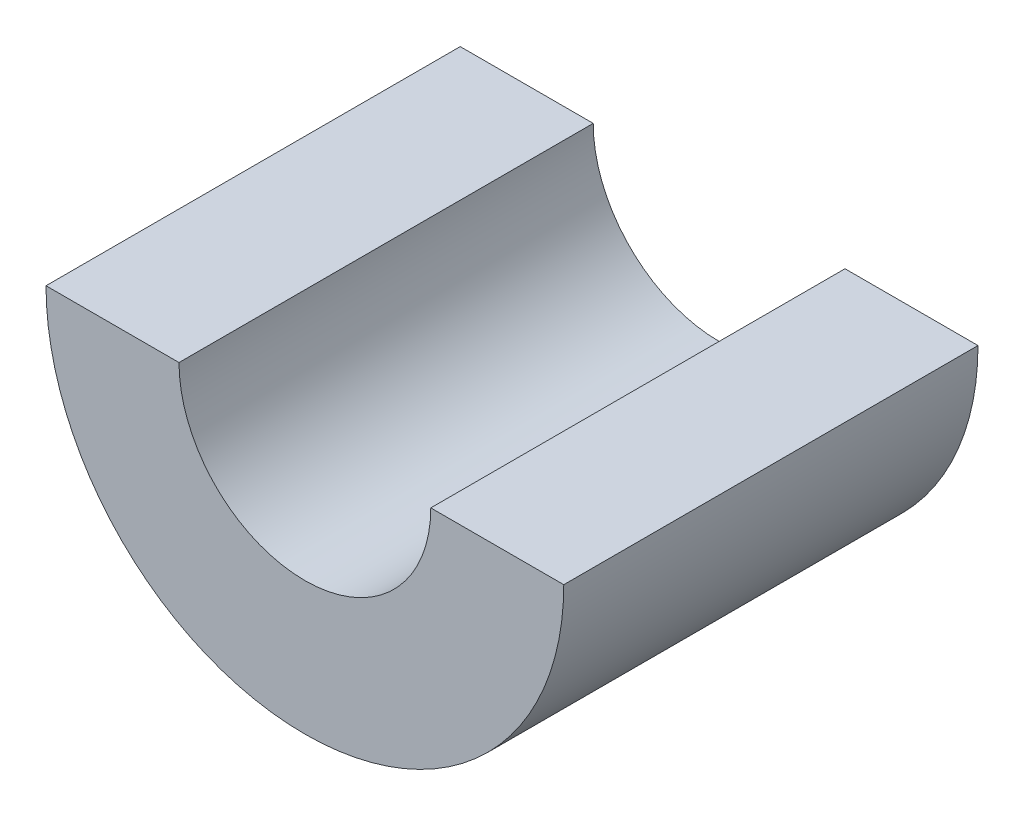
ISO-10303-21;
HEADER;
FILE_DESCRIPTION(('STEP AP214'),'2;1');
FILE_NAME('part.step','',(''),(''),'','','');
FILE_SCHEMA(('AUTOMOTIVE_DESIGN { 1 0 10303 214 1 1 1 1 }'));
ENDSEC;
DATA;
#1=APPLICATION_CONTEXT('core data for automotive mechanical design processes');
#2=APPLICATION_PROTOCOL_DEFINITION('international standard','automotive_design',2000,#1);
#3=PRODUCT_CONTEXT('',#1,'mechanical');
#4=PRODUCT('Part','Part','',(#3));
#5=PRODUCT_RELATED_PRODUCT_CATEGORY('part','',(#4));
#6=PRODUCT_DEFINITION_FORMATION('','',#4);
#7=PRODUCT_DEFINITION_CONTEXT('part definition',#1,'design');
#8=PRODUCT_DEFINITION('design','',#6,#7);
#9=PRODUCT_DEFINITION_SHAPE('','',#8);
#10=(LENGTH_UNIT() NAMED_UNIT(*) SI_UNIT(.MILLI.,.METRE.));
#11=(NAMED_UNIT(*) PLANE_ANGLE_UNIT() SI_UNIT($,.RADIAN.));
#12=(NAMED_UNIT(*) SI_UNIT($,.STERADIAN.) SOLID_ANGLE_UNIT());
#13=UNCERTAINTY_MEASURE_WITH_UNIT(LENGTH_MEASURE(1.E-05),#10,'distance_accuracy_value','');
#14=(GEOMETRIC_REPRESENTATION_CONTEXT(3) GLOBAL_UNCERTAINTY_ASSIGNED_CONTEXT((#13)) GLOBAL_UNIT_ASSIGNED_CONTEXT((#10,
#11,#12)) REPRESENTATION_CONTEXT('',''));
#15=CARTESIAN_POINT('',(0.,0.,0.));
#16=DIRECTION('',(0.,0.,1.));
#17=DIRECTION('',(1.,0.,0.));
#18=AXIS2_PLACEMENT_3D('',#15,#16,#17);
#19=CARTESIAN_POINT('',(0.,0.,8.));
#20=DIRECTION('',(0.,1.,0.));
#21=DIRECTION('',(0.,0.,1.));
#22=AXIS2_PLACEMENT_3D('',#19,#20,#21);
#23=PLANE('',#22);
#24=DIRECTION('',(1.,0.,0.));
#25=VECTOR('',#24,1.);
#26=CARTESIAN_POINT('',(0.,0.,0.));
#27=LINE('',#26,#25);
#28=CARTESIAN_POINT('',(-5.,0.,0.));
#29=VERTEX_POINT('',#28);
#30=CARTESIAN_POINT('',(-2.43137084989848,0.,0.));
#31=VERTEX_POINT('',#30);
#32=EDGE_CURVE('E122',#29,#31,#27,.T.);
#33=ORIENTED_EDGE('',*,*,#32,.F.);
#34=DIRECTION('',(0.,0.,-1.));
#35=VECTOR('',#34,1.);
#36=CARTESIAN_POINT('',(-5.,0.,8.));
#37=LINE('',#36,#35);
#38=CARTESIAN_POINT('',(-5.,0.,8.));
#39=VERTEX_POINT('',#38);
#40=EDGE_CURVE('E11',#39,#29,#37,.T.);
#41=ORIENTED_EDGE('',*,*,#40,.F.);
#42=DIRECTION('',(1.,0.,0.));
#43=VECTOR('',#42,1.);
#44=CARTESIAN_POINT('',(0.,0.,8.));
#45=LINE('',#44,#43);
#46=CARTESIAN_POINT('',(-2.43137084989848,0.,8.));
#47=VERTEX_POINT('',#46);
#48=EDGE_CURVE('E97',#39,#47,#45,.T.);
#49=ORIENTED_EDGE('',*,*,#48,.T.);
#50=DIRECTION('',(0.,0.,-1.));
#51=VECTOR('',#50,1.);
#52=CARTESIAN_POINT('',(-2.43137084989848,0.,8.));
#53=LINE('',#52,#51);
#54=EDGE_CURVE('E65',#47,#31,#53,.T.);
#55=ORIENTED_EDGE('',*,*,#54,.T.);
#56=EDGE_LOOP('',(#33,#41,#49,#55));
#57=FACE_BOUND('',#56,.T.);
#58=ADVANCED_FACE('F47',(#57),#23,.T.);
#59=CARTESIAN_POINT('',(0.,0.,8.));
#60=DIRECTION('',(0.,0.,-1.));
#61=DIRECTION('',(-1.,0.,0.));
#62=AXIS2_PLACEMENT_3D('',#59,#60,#61);
#63=CYLINDRICAL_SURFACE('',#62,5.);
#64=CARTESIAN_POINT('',(0.,0.,0.));
#65=DIRECTION('',(0.,0.,1.));
#66=DIRECTION('',(1.,0.,0.));
#67=AXIS2_PLACEMENT_3D('',#64,#65,#66);
#68=CIRCLE('',#67,5.);
#69=CARTESIAN_POINT('',(5.,0.,0.));
#70=VERTEX_POINT('',#69);
#71=EDGE_CURVE('E103',#29,#70,#68,.T.);
#72=ORIENTED_EDGE('',*,*,#71,.T.);
#73=DIRECTION('',(0.,0.,-1.));
#74=VECTOR('',#73,1.);
#75=CARTESIAN_POINT('',(5.,0.,8.));
#76=LINE('',#75,#74);
#77=CARTESIAN_POINT('',(5.,0.,8.));
#78=VERTEX_POINT('',#77);
#79=EDGE_CURVE('E57',#78,#70,#76,.T.);
#80=ORIENTED_EDGE('',*,*,#79,.F.);
#81=CARTESIAN_POINT('',(0.,0.,8.));
#82=DIRECTION('',(0.,0.,1.));
#83=DIRECTION('',(1.,0.,0.));
#84=AXIS2_PLACEMENT_3D('',#81,#82,#83);
#85=CIRCLE('',#84,5.);
#86=EDGE_CURVE('E91',#39,#78,#85,.T.);
#87=ORIENTED_EDGE('',*,*,#86,.F.);
#88=ORIENTED_EDGE('',*,*,#40,.T.);
#89=EDGE_LOOP('',(#72,#80,#87,#88));
#90=FACE_BOUND('',#89,.T.);
#91=ADVANCED_FACE('F49',(#90),#63,.T.);
#92=CARTESIAN_POINT('',(2.43137084989848,0.,0.));
#93=VERTEX_POINT('',#92);
#94=EDGE_CURVE('E117',#93,#70,#27,.T.);
#95=ORIENTED_EDGE('',*,*,#94,.F.);
#96=DIRECTION('',(0.,0.,-1.));
#97=VECTOR('',#96,1.);
#98=CARTESIAN_POINT('',(2.43137084989848,0.,8.));
#99=LINE('',#98,#97);
#100=CARTESIAN_POINT('',(2.43137084989848,0.,8.));
#101=VERTEX_POINT('',#100);
#102=EDGE_CURVE('E78',#101,#93,#99,.T.);
#103=ORIENTED_EDGE('',*,*,#102,.F.);
#104=EDGE_CURVE('E96',#101,#78,#45,.T.);
#105=ORIENTED_EDGE('',*,*,#104,.T.);
#106=ORIENTED_EDGE('',*,*,#79,.T.);
#107=EDGE_LOOP('',(#95,#103,#105,#106));
#108=FACE_BOUND('',#107,.T.);
#109=ADVANCED_FACE('F107',(#108),#23,.T.);
#110=CARTESIAN_POINT('',(0.,0.,8.));
#111=DIRECTION('',(0.,0.,-1.));
#112=DIRECTION('',(-1.,0.,0.));
#113=AXIS2_PLACEMENT_3D('',#110,#111,#112);
#114=CYLINDRICAL_SURFACE('',#113,2.43137084989848);
#115=CARTESIAN_POINT('',(0.,0.,0.));
#116=DIRECTION('',(0.,0.,1.));
#117=DIRECTION('',(1.,0.,0.));
#118=AXIS2_PLACEMENT_3D('',#115,#116,#117);
#119=CIRCLE('',#118,2.43137084989848);
#120=EDGE_CURVE('E114',#31,#93,#119,.T.);
#121=ORIENTED_EDGE('',*,*,#120,.F.);
#122=ORIENTED_EDGE('',*,*,#54,.F.);
#123=CARTESIAN_POINT('',(0.,0.,8.));
#124=DIRECTION('',(0.,0.,1.));
#125=DIRECTION('',(1.,0.,0.));
#126=AXIS2_PLACEMENT_3D('',#123,#124,#125);
#127=CIRCLE('',#126,2.43137084989848);
#128=EDGE_CURVE('E109',#47,#101,#127,.T.);
#129=ORIENTED_EDGE('',*,*,#128,.T.);
#130=ORIENTED_EDGE('',*,*,#102,.T.);
#131=EDGE_LOOP('',(#121,#122,#129,#130));
#132=FACE_BOUND('',#131,.T.);
#133=ADVANCED_FACE('F131',(#132),#114,.F.);
#134=CARTESIAN_POINT('',(0.,0.,8.));
#135=DIRECTION('',(0.,0.,1.));
#136=DIRECTION('',(1.,0.,0.));
#137=AXIS2_PLACEMENT_3D('',#134,#135,#136);
#138=PLANE('',#137);
#139=ORIENTED_EDGE('',*,*,#48,.F.);
#140=ORIENTED_EDGE('',*,*,#86,.T.);
#141=ORIENTED_EDGE('',*,*,#104,.F.);
#142=ORIENTED_EDGE('',*,*,#128,.F.);
#143=EDGE_LOOP('',(#139,#140,#141,#142));
#144=FACE_BOUND('',#143,.T.);
#145=ADVANCED_FACE('F93',(#144),#138,.T.);
#146=CARTESIAN_POINT('',(0.,0.,0.));
#147=DIRECTION('',(0.,0.,1.));
#148=DIRECTION('',(1.,0.,0.));
#149=AXIS2_PLACEMENT_3D('',#146,#147,#148);
#150=PLANE('',#149);
#151=ORIENTED_EDGE('',*,*,#32,.T.);
#152=ORIENTED_EDGE('',*,*,#120,.T.);
#153=ORIENTED_EDGE('',*,*,#94,.T.);
#154=ORIENTED_EDGE('',*,*,#71,.F.);
#155=EDGE_LOOP('',(#151,#152,#153,#154));
#156=FACE_BOUND('',#155,.T.);
#157=ADVANCED_FACE('F130',(#156),#150,.F.);
#158=CLOSED_SHELL('',(#58,#91,#109,#133,#145,#157));
#159=MANIFOLD_SOLID_BREP('B2',#158);
#160=ADVANCED_BREP_SHAPE_REPRESENTATION('',(#18,#159),#14);
#161=SHAPE_DEFINITION_REPRESENTATION(#9,#160);
ENDSEC;
END-ISO-10303-21;
